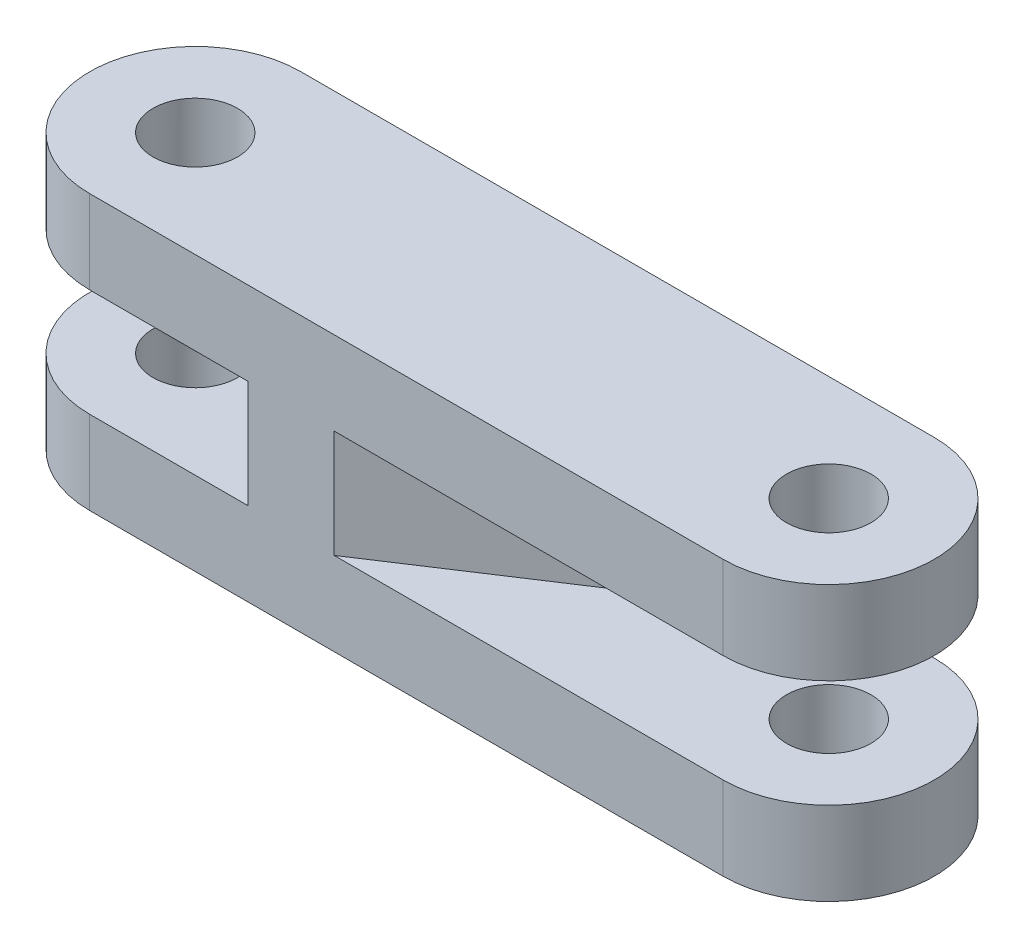
ISO-10303-21;
HEADER;
FILE_DESCRIPTION(('STEP AP214'),'2;1');
FILE_NAME('part.step','',(''),(''),'','','');
FILE_SCHEMA(('AUTOMOTIVE_DESIGN { 1 0 10303 214 1 1 1 1 }'));
ENDSEC;
DATA;
#1=APPLICATION_CONTEXT('core data for automotive mechanical design processes');
#2=APPLICATION_PROTOCOL_DEFINITION('international standard','automotive_design',2000,#1);
#3=PRODUCT_CONTEXT('',#1,'mechanical');
#4=PRODUCT('Part','Part','',(#3));
#5=PRODUCT_RELATED_PRODUCT_CATEGORY('part','',(#4));
#6=PRODUCT_DEFINITION_FORMATION('','',#4);
#7=PRODUCT_DEFINITION_CONTEXT('part definition',#1,'design');
#8=PRODUCT_DEFINITION('design','',#6,#7);
#9=PRODUCT_DEFINITION_SHAPE('','',#8);
#10=(LENGTH_UNIT() NAMED_UNIT(*) SI_UNIT(.MILLI.,.METRE.));
#11=(NAMED_UNIT(*) PLANE_ANGLE_UNIT() SI_UNIT($,.RADIAN.));
#12=(NAMED_UNIT(*) SI_UNIT($,.STERADIAN.) SOLID_ANGLE_UNIT());
#13=UNCERTAINTY_MEASURE_WITH_UNIT(LENGTH_MEASURE(1.E-05),#10,'distance_accuracy_value','');
#14=(GEOMETRIC_REPRESENTATION_CONTEXT(3) GLOBAL_UNCERTAINTY_ASSIGNED_CONTEXT((#13)) GLOBAL_UNIT_ASSIGNED_CONTEXT((#10,
#11,#12)) REPRESENTATION_CONTEXT('',''));
#15=CARTESIAN_POINT('',(0.,0.,0.));
#16=DIRECTION('',(0.,0.,1.));
#17=DIRECTION('',(1.,0.,0.));
#18=AXIS2_PLACEMENT_3D('',#15,#16,#17);
#19=CARTESIAN_POINT('',(-10.3744813820519,-13.,32.1786968159599));
#20=DIRECTION('',(0.,0.,1.));
#21=DIRECTION('',(1.,0.,0.));
#22=AXIS2_PLACEMENT_3D('',#19,#20,#21);
#23=PLANE('',#22);
#24=DIRECTION('',(1.,0.,0.));
#25=VECTOR('',#24,1.);
#26=CARTESIAN_POINT('',(-10.3744813820519,-3.95,32.1786968159599));
#27=LINE('',#26,#25);
#28=CARTESIAN_POINT('',(-10.3744813820519,-3.95,32.1786968159599));
#29=VERTEX_POINT('',#28);
#30=CARTESIAN_POINT('',(11.4805822929025,-3.95,32.1786968159599));
#31=VERTEX_POINT('',#30);
#32=EDGE_CURVE('E110',#29,#31,#27,.T.);
#33=ORIENTED_EDGE('',*,*,#32,.F.);
#34=DIRECTION('',(0.,1.,0.));
#35=VECTOR('',#34,1.);
#36=CARTESIAN_POINT('',(-10.3744813820519,-13.,32.1786968159599));
#37=LINE('',#36,#35);
#38=CARTESIAN_POINT('',(-10.3744813820519,0.,32.1786968159599));
#39=VERTEX_POINT('',#38);
#40=EDGE_CURVE('E23',#29,#39,#37,.T.);
#41=ORIENTED_EDGE('',*,*,#40,.T.);
#42=DIRECTION('',(1.,0.,0.));
#43=VECTOR('',#42,1.);
#44=CARTESIAN_POINT('',(-10.3744813820519,0.,32.1786968159599));
#45=LINE('',#44,#43);
#46=CARTESIAN_POINT('',(19.6255186179481,0.,32.1786968159599));
#47=VERTEX_POINT('',#46);
#48=EDGE_CURVE('E195',#39,#47,#45,.T.);
#49=ORIENTED_EDGE('',*,*,#48,.T.);
#50=DIRECTION('',(0.,1.,0.));
#51=VECTOR('',#50,1.);
#52=CARTESIAN_POINT('',(19.6255186179481,-13.,32.1786968159599));
#53=LINE('',#52,#51);
#54=CARTESIAN_POINT('',(19.6255186179481,-3.95,32.1786968159599));
#55=VERTEX_POINT('',#54);
#56=EDGE_CURVE('E132',#55,#47,#53,.T.);
#57=ORIENTED_EDGE('',*,*,#56,.F.);
#58=DIRECTION('',(1.,0.,0.));
#59=VECTOR('',#58,1.);
#60=CARTESIAN_POINT('',(16.4545302381828,-3.95,32.1786968159599));
#61=LINE('',#60,#59);
#62=CARTESIAN_POINT('',(16.4545302381828,-3.95,32.1786968159599));
#63=VERTEX_POINT('',#62);
#64=EDGE_CURVE('E160',#63,#55,#61,.T.);
#65=ORIENTED_EDGE('',*,*,#64,.F.);
#66=DIRECTION('',(0.,-1.,0.));
#67=VECTOR('',#66,1.);
#68=CARTESIAN_POINT('',(16.4545302381828,-3.95,32.1786968159599));
#69=LINE('',#68,#67);
#70=CARTESIAN_POINT('',(16.4545302381828,-9.05,32.1786968159599));
#71=VERTEX_POINT('',#70);
#72=EDGE_CURVE('E165',#63,#71,#69,.T.);
#73=ORIENTED_EDGE('',*,*,#72,.T.);
#74=DIRECTION('',(1.,0.,0.));
#75=VECTOR('',#74,1.);
#76=CARTESIAN_POINT('',(16.4545302381828,-9.05,32.1786968159599));
#77=LINE('',#76,#75);
#78=CARTESIAN_POINT('',(19.6255186179481,-9.05,32.1786968159599));
#79=VERTEX_POINT('',#78);
#80=EDGE_CURVE('E171',#71,#79,#77,.T.);
#81=ORIENTED_EDGE('',*,*,#80,.T.);
#82=CARTESIAN_POINT('',(19.6255186179481,-13.,32.1786968159599));
#83=VERTEX_POINT('',#82);
#84=EDGE_CURVE('E130',#83,#79,#53,.T.);
#85=ORIENTED_EDGE('',*,*,#84,.F.);
#86=DIRECTION('',(1.,0.,0.));
#87=VECTOR('',#86,1.);
#88=CARTESIAN_POINT('',(-10.3744813820519,-13.,32.1786968159599));
#89=LINE('',#88,#87);
#90=CARTESIAN_POINT('',(-10.3744813820519,-13.,32.1786968159599));
#91=VERTEX_POINT('',#90);
#92=EDGE_CURVE('E196',#91,#83,#89,.T.);
#93=ORIENTED_EDGE('',*,*,#92,.F.);
#94=CARTESIAN_POINT('',(-10.3744813820519,-9.05,32.1786968159599));
#95=VERTEX_POINT('',#94);
#96=EDGE_CURVE('E9',#91,#95,#37,.T.);
#97=ORIENTED_EDGE('',*,*,#96,.T.);
#98=DIRECTION('',(1.,0.,0.));
#99=VECTOR('',#98,1.);
#100=CARTESIAN_POINT('',(-10.3744813820519,-9.05,32.1786968159599));
#101=LINE('',#100,#99);
#102=CARTESIAN_POINT('',(11.4805822929025,-9.05,32.1786968159599));
#103=VERTEX_POINT('',#102);
#104=EDGE_CURVE('E31',#95,#103,#101,.T.);
#105=ORIENTED_EDGE('',*,*,#104,.T.);
#106=DIRECTION('',(0.,-1.,0.));
#107=VECTOR('',#106,1.);
#108=CARTESIAN_POINT('',(11.4805822929025,-3.95,32.1786968159599));
#109=LINE('',#108,#107);
#110=EDGE_CURVE('E123',#31,#103,#109,.T.);
#111=ORIENTED_EDGE('',*,*,#110,.F.);
#112=EDGE_LOOP('',(#33,#41,#49,#57,#65,#73,#81,#85,#93,#97,#105,#111));
#113=FACE_BOUND('',#112,.T.);
#114=ADVANCED_FACE('F15',(#113),#23,.F.);
#115=CARTESIAN_POINT('',(19.6255186179481,-13.,42.1786968159599));
#116=DIRECTION('',(0.,0.,-1.));
#117=DIRECTION('',(-1.,0.,0.));
#118=AXIS2_PLACEMENT_3D('',#115,#116,#117);
#119=PLANE('',#118);
#120=DIRECTION('',(-1.,0.,0.));
#121=VECTOR('',#120,1.);
#122=CARTESIAN_POINT('',(-2.8700991021096,-3.95,42.1786968159599));
#123=LINE('',#122,#121);
#124=CARTESIAN_POINT('',(-2.8700991021096,-3.95,42.1786968159599));
#125=VERTEX_POINT('',#124);
#126=CARTESIAN_POINT('',(-10.3744813820519,-3.95,42.1786968159599));
#127=VERTEX_POINT('',#126);
#128=EDGE_CURVE('E113',#125,#127,#123,.T.);
#129=ORIENTED_EDGE('',*,*,#128,.F.);
#130=DIRECTION('',(0.,-1.,0.));
#131=VECTOR('',#130,1.);
#132=CARTESIAN_POINT('',(-2.8700991021096,-3.95,42.1786968159599));
#133=LINE('',#132,#131);
#134=CARTESIAN_POINT('',(-2.8700991021096,-9.05,42.1786968159599));
#135=VERTEX_POINT('',#134);
#136=EDGE_CURVE('E149',#125,#135,#133,.T.);
#137=ORIENTED_EDGE('',*,*,#136,.T.);
#138=DIRECTION('',(-1.,0.,0.));
#139=VECTOR('',#138,1.);
#140=CARTESIAN_POINT('',(-2.8700991021096,-9.05,42.1786968159599));
#141=LINE('',#140,#139);
#142=CARTESIAN_POINT('',(-10.3744813820519,-9.05,42.1786968159599));
#143=VERTEX_POINT('',#142);
#144=EDGE_CURVE('E117',#135,#143,#141,.T.);
#145=ORIENTED_EDGE('',*,*,#144,.T.);
#146=DIRECTION('',(0.,1.,0.));
#147=VECTOR('',#146,1.);
#148=CARTESIAN_POINT('',(-10.3744813820519,-13.,42.1786968159599));
#149=LINE('',#148,#147);
#150=CARTESIAN_POINT('',(-10.3744813820519,-13.,42.1786968159599));
#151=VERTEX_POINT('',#150);
#152=EDGE_CURVE('E217',#151,#143,#149,.T.);
#153=ORIENTED_EDGE('',*,*,#152,.F.);
#154=DIRECTION('',(-1.,0.,0.));
#155=VECTOR('',#154,1.);
#156=CARTESIAN_POINT('',(19.6255186179481,-13.,42.1786968159599));
#157=LINE('',#156,#155);
#158=CARTESIAN_POINT('',(19.6255186179481,-13.,42.1786968159599));
#159=VERTEX_POINT('',#158);
#160=EDGE_CURVE('E200',#159,#151,#157,.T.);
#161=ORIENTED_EDGE('',*,*,#160,.F.);
#162=DIRECTION('',(0.,1.,0.));
#163=VECTOR('',#162,1.);
#164=CARTESIAN_POINT('',(19.6255186179481,-13.,42.1786968159599));
#165=LINE('',#164,#163);
#166=CARTESIAN_POINT('',(19.6255186179481,-9.05,42.1786968159599));
#167=VERTEX_POINT('',#166);
#168=EDGE_CURVE('E220',#159,#167,#165,.T.);
#169=ORIENTED_EDGE('',*,*,#168,.T.);
#170=DIRECTION('',(-1.,0.,0.));
#171=VECTOR('',#170,1.);
#172=CARTESIAN_POINT('',(19.6255186179481,-9.05,42.1786968159599));
#173=LINE('',#172,#171);
#174=CARTESIAN_POINT('',(1.20526391813,-9.05,42.1786968159599));
#175=VERTEX_POINT('',#174);
#176=EDGE_CURVE('E148',#167,#175,#173,.T.);
#177=ORIENTED_EDGE('',*,*,#176,.T.);
#178=DIRECTION('',(0.,-1.,0.));
#179=VECTOR('',#178,1.);
#180=CARTESIAN_POINT('',(1.20526391813,-3.95,42.1786968159599));
#181=LINE('',#180,#179);
#182=CARTESIAN_POINT('',(1.20526391813,-3.95,42.1786968159599));
#183=VERTEX_POINT('',#182);
#184=EDGE_CURVE('E140',#183,#175,#181,.T.);
#185=ORIENTED_EDGE('',*,*,#184,.F.);
#186=DIRECTION('',(-1.,0.,0.));
#187=VECTOR('',#186,1.);
#188=CARTESIAN_POINT('',(19.6255186179481,-3.95,42.1786968159599));
#189=LINE('',#188,#187);
#190=CARTESIAN_POINT('',(19.6255186179481,-3.95,42.1786968159599));
#191=VERTEX_POINT('',#190);
#192=EDGE_CURVE('E161',#191,#183,#189,.T.);
#193=ORIENTED_EDGE('',*,*,#192,.F.);
#194=CARTESIAN_POINT('',(19.6255186179481,0.,42.1786968159599));
#195=VERTEX_POINT('',#194);
#196=EDGE_CURVE('E219',#191,#195,#165,.T.);
#197=ORIENTED_EDGE('',*,*,#196,.T.);
#198=DIRECTION('',(-1.,0.,0.));
#199=VECTOR('',#198,1.);
#200=CARTESIAN_POINT('',(19.6255186179481,0.,42.1786968159599));
#201=LINE('',#200,#199);
#202=CARTESIAN_POINT('',(-10.3744813820519,0.,42.1786968159599));
#203=VERTEX_POINT('',#202);
#204=EDGE_CURVE('E211',#195,#203,#201,.T.);
#205=ORIENTED_EDGE('',*,*,#204,.T.);
#206=EDGE_CURVE('E204',#127,#203,#149,.T.);
#207=ORIENTED_EDGE('',*,*,#206,.F.);
#208=EDGE_LOOP('',(#129,#137,#145,#153,#161,#169,#177,#185,#193,#197,#205,#207));
#209=FACE_BOUND('',#208,.T.);
#210=ADVANCED_FACE('F227',(#209),#119,.F.);
#211=CARTESIAN_POINT('',(-10.3744813820519,-13.,37.1786968159599));
#212=DIRECTION('',(0.,1.,0.));
#213=DIRECTION('',(0.,0.,1.));
#214=AXIS2_PLACEMENT_3D('',#211,#212,#213);
#215=CYLINDRICAL_SURFACE('',#214,5.);
#216=CARTESIAN_POINT('',(-10.3744813820519,-3.95,37.1786968159599));
#217=DIRECTION('',(0.,-1.,0.));
#218=DIRECTION('',(1.,0.,0.));
#219=AXIS2_PLACEMENT_3D('',#216,#217,#218);
#220=CIRCLE('',#219,5.);
#221=EDGE_CURVE('E105',#127,#29,#220,.T.);
#222=ORIENTED_EDGE('',*,*,#221,.F.);
#223=ORIENTED_EDGE('',*,*,#206,.T.);
#224=CARTESIAN_POINT('',(-10.3744813820519,0.,37.1786968159599));
#225=DIRECTION('',(0.,-1.,0.));
#226=DIRECTION('',(1.,0.,0.));
#227=AXIS2_PLACEMENT_3D('',#224,#225,#226);
#228=CIRCLE('',#227,5.);
#229=EDGE_CURVE('E128',#203,#39,#228,.T.);
#230=ORIENTED_EDGE('',*,*,#229,.T.);
#231=ORIENTED_EDGE('',*,*,#40,.F.);
#232=EDGE_LOOP('',(#222,#223,#230,#231));
#233=FACE_BOUND('',#232,.T.);
#234=ADVANCED_FACE('F126',(#233),#215,.T.);
#235=CARTESIAN_POINT('',(-10.3744813820519,0.,37.1786968159599));
#236=DIRECTION('',(0.,-1.,0.));
#237=DIRECTION('',(0.,0.,1.));
#238=AXIS2_PLACEMENT_3D('',#235,#236,#237);
#239=CYLINDRICAL_SURFACE('',#238,2.);
#240=CARTESIAN_POINT('',(-10.3744813820519,0.,37.1786968159599));
#241=DIRECTION('',(0.,-1.,0.));
#242=DIRECTION('',(0.,0.,1.));
#243=AXIS2_PLACEMENT_3D('',#240,#241,#242);
#244=CIRCLE('',#243,2.);
#245=CARTESIAN_POINT('',(-10.3744813820519,0.,39.1786968159599));
#246=VERTEX_POINT('',#245);
#247=EDGE_CURVE('E189',#246,#246,#244,.T.);
#248=ORIENTED_EDGE('',*,*,#247,.F.);
#249=EDGE_LOOP('',(#248));
#250=FACE_BOUND('',#249,.T.);
#251=CARTESIAN_POINT('',(-10.3744813820519,-3.95,37.1786968159599));
#252=DIRECTION('',(0.,-1.,0.));
#253=DIRECTION('',(0.,0.,-1.));
#254=AXIS2_PLACEMENT_3D('',#251,#252,#253);
#255=CIRCLE('',#254,2.);
#256=CARTESIAN_POINT('',(-10.3744813820519,-3.95,35.1786968159599));
#257=VERTEX_POINT('',#256);
#258=EDGE_CURVE('E18',#257,#257,#255,.F.);
#259=ORIENTED_EDGE('',*,*,#258,.F.);
#260=EDGE_LOOP('',(#259));
#261=FACE_BOUND('',#260,.T.);
#262=ADVANCED_FACE('F290',(#250,#261),#239,.F.);
#263=CARTESIAN_POINT('',(19.6255186179481,-13.,37.1786968159599));
#264=DIRECTION('',(0.,1.,0.));
#265=DIRECTION('',(0.,0.,1.));
#266=AXIS2_PLACEMENT_3D('',#263,#264,#265);
#267=CYLINDRICAL_SURFACE('',#266,5.);
#268=CARTESIAN_POINT('',(19.6255186179481,-3.95,37.1786968159599));
#269=DIRECTION('',(0.,-1.,0.));
#270=DIRECTION('',(-1.,0.,0.));
#271=AXIS2_PLACEMENT_3D('',#268,#269,#270);
#272=CIRCLE('',#271,5.);
#273=EDGE_CURVE('E163',#55,#191,#272,.T.);
#274=ORIENTED_EDGE('',*,*,#273,.F.);
#275=ORIENTED_EDGE('',*,*,#56,.T.);
#276=CARTESIAN_POINT('',(19.6255186179481,0.,37.1786968159599));
#277=DIRECTION('',(0.,-1.,0.));
#278=DIRECTION('',(-1.,0.,0.));
#279=AXIS2_PLACEMENT_3D('',#276,#277,#278);
#280=CIRCLE('',#279,5.);
#281=EDGE_CURVE('E207',#47,#195,#280,.T.);
#282=ORIENTED_EDGE('',*,*,#281,.T.);
#283=ORIENTED_EDGE('',*,*,#196,.F.);
#284=EDGE_LOOP('',(#274,#275,#282,#283));
#285=FACE_BOUND('',#284,.T.);
#286=ADVANCED_FACE('F233',(#285),#267,.T.);
#287=CARTESIAN_POINT('',(19.6255186179481,0.,37.1786968159599));
#288=DIRECTION('',(0.,-1.,0.));
#289=DIRECTION('',(0.,0.,1.));
#290=AXIS2_PLACEMENT_3D('',#287,#288,#289);
#291=CYLINDRICAL_SURFACE('',#290,2.);
#292=CARTESIAN_POINT('',(19.6255186179481,0.,37.1786968159599));
#293=DIRECTION('',(0.,-1.,0.));
#294=DIRECTION('',(0.,0.,1.));
#295=AXIS2_PLACEMENT_3D('',#292,#293,#294);
#296=CIRCLE('',#295,2.);
#297=CARTESIAN_POINT('',(19.6255186179481,0.,39.1786968159599));
#298=VERTEX_POINT('',#297);
#299=EDGE_CURVE('E142',#298,#298,#296,.T.);
#300=ORIENTED_EDGE('',*,*,#299,.F.);
#301=EDGE_LOOP('',(#300));
#302=FACE_BOUND('',#301,.T.);
#303=CARTESIAN_POINT('',(19.6255186179481,-3.95,37.1786968159599));
#304=DIRECTION('',(0.,-1.,0.));
#305=DIRECTION('',(0.,0.,-1.));
#306=AXIS2_PLACEMENT_3D('',#303,#304,#305);
#307=CIRCLE('',#306,2.);
#308=CARTESIAN_POINT('',(19.6255186179481,-3.95,35.1786968159599));
#309=VERTEX_POINT('',#308);
#310=EDGE_CURVE('E139',#309,#309,#307,.F.);
#311=ORIENTED_EDGE('',*,*,#310,.F.);
#312=EDGE_LOOP('',(#311));
#313=FACE_BOUND('',#312,.T.);
#314=ADVANCED_FACE('F294',(#302,#313),#291,.F.);
#315=ORIENTED_EDGE('',*,*,#84,.T.);
#316=CARTESIAN_POINT('',(19.6255186179481,-9.05,37.1786968159599));
#317=DIRECTION('',(0.,-1.,0.));
#318=DIRECTION('',(-1.,0.,0.));
#319=AXIS2_PLACEMENT_3D('',#316,#317,#318);
#320=CIRCLE('',#319,5.);
#321=EDGE_CURVE('E168',#79,#167,#320,.T.);
#322=ORIENTED_EDGE('',*,*,#321,.T.);
#323=ORIENTED_EDGE('',*,*,#168,.F.);
#324=CARTESIAN_POINT('',(19.6255186179481,-13.,37.1786968159599));
#325=DIRECTION('',(0.,-1.,0.));
#326=DIRECTION('',(-1.,0.,0.));
#327=AXIS2_PLACEMENT_3D('',#324,#325,#326);
#328=CIRCLE('',#327,5.);
#329=EDGE_CURVE('E198',#83,#159,#328,.T.);
#330=ORIENTED_EDGE('',*,*,#329,.F.);
#331=EDGE_LOOP('',(#315,#322,#323,#330));
#332=FACE_BOUND('',#331,.T.);
#333=ADVANCED_FACE('F246',(#332),#267,.T.);
#334=ORIENTED_EDGE('',*,*,#152,.T.);
#335=CARTESIAN_POINT('',(-10.3744813820519,-9.05,37.1786968159599));
#336=DIRECTION('',(0.,-1.,0.));
#337=DIRECTION('',(1.,0.,0.));
#338=AXIS2_PLACEMENT_3D('',#335,#336,#337);
#339=CIRCLE('',#338,5.);
#340=EDGE_CURVE('E255',#143,#95,#339,.T.);
#341=ORIENTED_EDGE('',*,*,#340,.T.);
#342=ORIENTED_EDGE('',*,*,#96,.F.);
#343=CARTESIAN_POINT('',(-10.3744813820519,-13.,37.1786968159599));
#344=DIRECTION('',(0.,-1.,0.));
#345=DIRECTION('',(1.,0.,0.));
#346=AXIS2_PLACEMENT_3D('',#343,#344,#345);
#347=CIRCLE('',#346,5.);
#348=EDGE_CURVE('E202',#151,#91,#347,.T.);
#349=ORIENTED_EDGE('',*,*,#348,.F.);
#350=EDGE_LOOP('',(#334,#341,#342,#349));
#351=FACE_BOUND('',#350,.T.);
#352=ADVANCED_FACE('F254',(#351),#215,.T.);
#353=CARTESIAN_POINT('',(-10.3744813820519,-13.,37.1786968159599));
#354=DIRECTION('',(0.,-1.,0.));
#355=DIRECTION('',(0.,0.,-1.));
#356=AXIS2_PLACEMENT_3D('',#353,#354,#355);
#357=PLANE('',#356);
#358=CARTESIAN_POINT('',(19.6255186179481,-13.,37.1786968159599));
#359=DIRECTION('',(0.,-1.,0.));
#360=DIRECTION('',(0.,0.,-1.));
#361=AXIS2_PLACEMENT_3D('',#358,#359,#360);
#362=CIRCLE('',#361,2.);
#363=CARTESIAN_POINT('',(19.6255186179481,-13.,35.1786968159599));
#364=VERTEX_POINT('',#363);
#365=EDGE_CURVE('E186',#364,#364,#362,.T.);
#366=ORIENTED_EDGE('',*,*,#365,.F.);
#367=EDGE_LOOP('',(#366));
#368=FACE_BOUND('',#367,.T.);
#369=CARTESIAN_POINT('',(-10.3744813820519,-13.,37.1786968159599));
#370=DIRECTION('',(0.,-1.,0.));
#371=DIRECTION('',(0.,0.,-1.));
#372=AXIS2_PLACEMENT_3D('',#369,#370,#371);
#373=CIRCLE('',#372,2.);
#374=CARTESIAN_POINT('',(-10.3744813820519,-13.,35.1786968159599));
#375=VERTEX_POINT('',#374);
#376=EDGE_CURVE('E192',#375,#375,#373,.T.);
#377=ORIENTED_EDGE('',*,*,#376,.F.);
#378=EDGE_LOOP('',(#377));
#379=FACE_BOUND('',#378,.T.);
#380=ORIENTED_EDGE('',*,*,#348,.T.);
#381=ORIENTED_EDGE('',*,*,#92,.T.);
#382=ORIENTED_EDGE('',*,*,#329,.T.);
#383=ORIENTED_EDGE('',*,*,#160,.T.);
#384=EDGE_LOOP('',(#380,#381,#382,#383));
#385=FACE_BOUND('',#384,.T.);
#386=ADVANCED_FACE('F299',(#368,#379,#385),#357,.T.);
#387=CARTESIAN_POINT('',(-10.3744813820519,0.,37.1786968159599));
#388=DIRECTION('',(0.,-1.,0.));
#389=DIRECTION('',(0.,0.,-1.));
#390=AXIS2_PLACEMENT_3D('',#387,#388,#389);
#391=PLANE('',#390);
#392=ORIENTED_EDGE('',*,*,#299,.T.);
#393=EDGE_LOOP('',(#392));
#394=FACE_BOUND('',#393,.T.);
#395=ORIENTED_EDGE('',*,*,#247,.T.);
#396=EDGE_LOOP('',(#395));
#397=FACE_BOUND('',#396,.T.);
#398=ORIENTED_EDGE('',*,*,#48,.F.);
#399=ORIENTED_EDGE('',*,*,#229,.F.);
#400=ORIENTED_EDGE('',*,*,#204,.F.);
#401=ORIENTED_EDGE('',*,*,#281,.F.);
#402=EDGE_LOOP('',(#398,#399,#400,#401));
#403=FACE_BOUND('',#402,.T.);
#404=ADVANCED_FACE('F236',(#394,#397,#403),#391,.F.);
#405=CARTESIAN_POINT('',(-10.3744813820519,-9.05,37.1786968159599));
#406=DIRECTION('',(0.,-1.,0.));
#407=DIRECTION('',(0.,0.,-1.));
#408=AXIS2_PLACEMENT_3D('',#405,#406,#407);
#409=CIRCLE('',#408,2.);
#410=CARTESIAN_POINT('',(-10.3744813820519,-9.05,35.1786968159599));
#411=VERTEX_POINT('',#410);
#412=EDGE_CURVE('E143',#411,#411,#409,.F.);
#413=ORIENTED_EDGE('',*,*,#412,.T.);
#414=EDGE_LOOP('',(#413));
#415=FACE_BOUND('',#414,.T.);
#416=ORIENTED_EDGE('',*,*,#376,.T.);
#417=EDGE_LOOP('',(#416));
#418=FACE_BOUND('',#417,.T.);
#419=ADVANCED_FACE('F309',(#415,#418),#239,.F.);
#420=CARTESIAN_POINT('',(19.6255186179481,-9.05,37.1786968159599));
#421=DIRECTION('',(0.,-1.,0.));
#422=DIRECTION('',(0.,0.,-1.));
#423=AXIS2_PLACEMENT_3D('',#420,#421,#422);
#424=CIRCLE('',#423,2.);
#425=CARTESIAN_POINT('',(19.6255186179481,-9.05,35.1786968159599));
#426=VERTEX_POINT('',#425);
#427=EDGE_CURVE('E136',#426,#426,#424,.F.);
#428=ORIENTED_EDGE('',*,*,#427,.T.);
#429=EDGE_LOOP('',(#428));
#430=FACE_BOUND('',#429,.T.);
#431=ORIENTED_EDGE('',*,*,#365,.T.);
#432=EDGE_LOOP('',(#431));
#433=FACE_BOUND('',#432,.T.);
#434=ADVANCED_FACE('F302',(#430,#433),#291,.F.);
#435=CARTESIAN_POINT('',(19.6255186179481,-3.95,37.1786968159599));
#436=DIRECTION('',(0.,-1.,0.));
#437=DIRECTION('',(0.,0.,-1.));
#438=AXIS2_PLACEMENT_3D('',#435,#436,#437);
#439=PLANE('',#438);
#440=ORIENTED_EDGE('',*,*,#192,.T.);
#441=DIRECTION('',(0.836232269244582,0.,-0.548375411441885));
#442=VECTOR('',#441,1.);
#443=CARTESIAN_POINT('',(1.20526391813,-3.95,42.1786968159599));
#444=LINE('',#443,#442);
#445=EDGE_CURVE('E157',#183,#63,#444,.T.);
#446=ORIENTED_EDGE('',*,*,#445,.T.);
#447=ORIENTED_EDGE('',*,*,#64,.T.);
#448=ORIENTED_EDGE('',*,*,#273,.T.);
#449=EDGE_LOOP('',(#440,#446,#447,#448));
#450=FACE_BOUND('',#449,.T.);
#451=ORIENTED_EDGE('',*,*,#310,.T.);
#452=EDGE_LOOP('',(#451));
#453=FACE_BOUND('',#452,.T.);
#454=ADVANCED_FACE('F239',(#450,#453),#439,.T.);
#455=CARTESIAN_POINT('',(19.6255186179481,-9.05,37.1786968159599));
#456=DIRECTION('',(0.,-1.,0.));
#457=DIRECTION('',(0.,0.,-1.));
#458=AXIS2_PLACEMENT_3D('',#455,#456,#457);
#459=PLANE('',#458);
#460=ORIENTED_EDGE('',*,*,#176,.F.);
#461=ORIENTED_EDGE('',*,*,#321,.F.);
#462=ORIENTED_EDGE('',*,*,#80,.F.);
#463=DIRECTION('',(0.836232269244582,0.,-0.548375411441885));
#464=VECTOR('',#463,1.);
#465=CARTESIAN_POINT('',(1.20526391813,-9.05,42.1786968159599));
#466=LINE('',#465,#464);
#467=EDGE_CURVE('E39',#175,#71,#466,.T.);
#468=ORIENTED_EDGE('',*,*,#467,.F.);
#469=EDGE_LOOP('',(#460,#461,#462,#468));
#470=FACE_BOUND('',#469,.T.);
#471=ORIENTED_EDGE('',*,*,#427,.F.);
#472=EDGE_LOOP('',(#471));
#473=FACE_BOUND('',#472,.T.);
#474=ADVANCED_FACE('F243',(#470,#473),#459,.F.);
#475=CARTESIAN_POINT('',(1.20526391813,-3.95,42.1786968159599));
#476=DIRECTION('',(-0.548375411441885,0.,-0.836232269244582));
#477=DIRECTION('',(-0.836232269244582,0.,0.548375411441885));
#478=AXIS2_PLACEMENT_3D('',#475,#476,#477);
#479=PLANE('',#478);
#480=ORIENTED_EDGE('',*,*,#467,.T.);
#481=ORIENTED_EDGE('',*,*,#72,.F.);
#482=ORIENTED_EDGE('',*,*,#445,.F.);
#483=ORIENTED_EDGE('',*,*,#184,.T.);
#484=EDGE_LOOP('',(#480,#481,#482,#483));
#485=FACE_BOUND('',#484,.T.);
#486=ADVANCED_FACE('F242',(#485),#479,.F.);
#487=CARTESIAN_POINT('',(-10.3744813820519,-3.95,37.1786968159599));
#488=DIRECTION('',(0.,-1.,0.));
#489=DIRECTION('',(0.,0.,-1.));
#490=AXIS2_PLACEMENT_3D('',#487,#488,#489);
#491=PLANE('',#490);
#492=ORIENTED_EDGE('',*,*,#221,.T.);
#493=ORIENTED_EDGE('',*,*,#32,.T.);
#494=DIRECTION('',(-0.820451534834467,0.,0.571716082498794));
#495=VECTOR('',#494,1.);
#496=CARTESIAN_POINT('',(-2.8700991021096,-3.95,42.1786968159599));
#497=LINE('',#496,#495);
#498=EDGE_CURVE('E124',#31,#125,#497,.T.);
#499=ORIENTED_EDGE('',*,*,#498,.T.);
#500=ORIENTED_EDGE('',*,*,#128,.T.);
#501=EDGE_LOOP('',(#492,#493,#499,#500));
#502=FACE_BOUND('',#501,.T.);
#503=ORIENTED_EDGE('',*,*,#258,.T.);
#504=EDGE_LOOP('',(#503));
#505=FACE_BOUND('',#504,.T.);
#506=ADVANCED_FACE('F107',(#502,#505),#491,.T.);
#507=CARTESIAN_POINT('',(-10.3744813820519,-9.05,37.1786968159599));
#508=DIRECTION('',(0.,-1.,0.));
#509=DIRECTION('',(0.,0.,-1.));
#510=AXIS2_PLACEMENT_3D('',#507,#508,#509);
#511=PLANE('',#510);
#512=ORIENTED_EDGE('',*,*,#340,.F.);
#513=ORIENTED_EDGE('',*,*,#144,.F.);
#514=DIRECTION('',(-0.820451534834467,0.,0.571716082498794));
#515=VECTOR('',#514,1.);
#516=CARTESIAN_POINT('',(-2.8700991021096,-9.05,42.1786968159599));
#517=LINE('',#516,#515);
#518=EDGE_CURVE('E262',#103,#135,#517,.T.);
#519=ORIENTED_EDGE('',*,*,#518,.F.);
#520=ORIENTED_EDGE('',*,*,#104,.F.);
#521=EDGE_LOOP('',(#512,#513,#519,#520));
#522=FACE_BOUND('',#521,.T.);
#523=ORIENTED_EDGE('',*,*,#412,.F.);
#524=EDGE_LOOP('',(#523));
#525=FACE_BOUND('',#524,.T.);
#526=ADVANCED_FACE('F271',(#522,#525),#511,.F.);
#527=CARTESIAN_POINT('',(-2.8700991021096,-3.95,42.1786968159599));
#528=DIRECTION('',(0.571716082498794,0.,0.820451534834467));
#529=DIRECTION('',(0.820451534834467,0.,-0.571716082498794));
#530=AXIS2_PLACEMENT_3D('',#527,#528,#529);
#531=PLANE('',#530);
#532=ORIENTED_EDGE('',*,*,#518,.T.);
#533=ORIENTED_EDGE('',*,*,#136,.F.);
#534=ORIENTED_EDGE('',*,*,#498,.F.);
#535=ORIENTED_EDGE('',*,*,#110,.T.);
#536=EDGE_LOOP('',(#532,#533,#534,#535));
#537=FACE_BOUND('',#536,.T.);
#538=ADVANCED_FACE('F270',(#537),#531,.F.);
#539=CLOSED_SHELL('',(#114,#210,#234,#262,#286,#314,#333,#352,#386,#404,#419,#434,#454,#474,
#486,#506,#526,#538));
#540=MANIFOLD_SOLID_BREP('B1',#539);
#541=ADVANCED_BREP_SHAPE_REPRESENTATION('',(#18,#540),#14);
#542=SHAPE_DEFINITION_REPRESENTATION(#9,#541);
ENDSEC;
END-ISO-10303-21;
